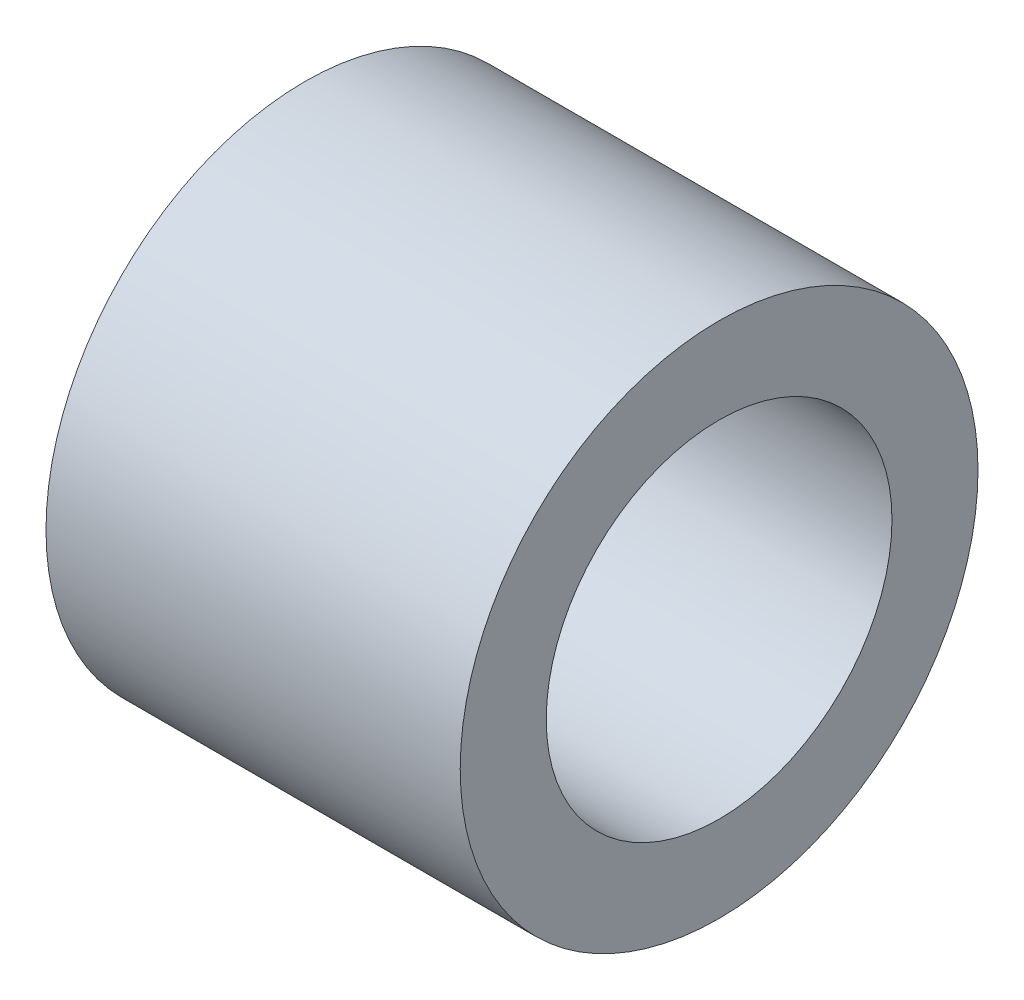
ISO-10303-21;
HEADER;
FILE_DESCRIPTION(('STEP AP214'),'2;1');
FILE_NAME('part.step','',(''),(''),'','','');
FILE_SCHEMA(('AUTOMOTIVE_DESIGN { 1 0 10303 214 1 1 1 1 }'));
ENDSEC;
DATA;
#1=APPLICATION_CONTEXT('core data for automotive mechanical design processes');
#2=APPLICATION_PROTOCOL_DEFINITION('international standard','automotive_design',2000,#1);
#3=PRODUCT_CONTEXT('',#1,'mechanical');
#4=PRODUCT('Part','Part','',(#3));
#5=PRODUCT_RELATED_PRODUCT_CATEGORY('part','',(#4));
#6=PRODUCT_DEFINITION_FORMATION('','',#4);
#7=PRODUCT_DEFINITION_CONTEXT('part definition',#1,'design');
#8=PRODUCT_DEFINITION('design','',#6,#7);
#9=PRODUCT_DEFINITION_SHAPE('','',#8);
#10=(LENGTH_UNIT() NAMED_UNIT(*) SI_UNIT(.MILLI.,.METRE.));
#11=(NAMED_UNIT(*) PLANE_ANGLE_UNIT() SI_UNIT($,.RADIAN.));
#12=(NAMED_UNIT(*) SI_UNIT($,.STERADIAN.) SOLID_ANGLE_UNIT());
#13=UNCERTAINTY_MEASURE_WITH_UNIT(LENGTH_MEASURE(1.E-05),#10,'distance_accuracy_value','');
#14=(GEOMETRIC_REPRESENTATION_CONTEXT(3) GLOBAL_UNCERTAINTY_ASSIGNED_CONTEXT((#13)) GLOBAL_UNIT_ASSIGNED_CONTEXT((#10,
#11,#12)) REPRESENTATION_CONTEXT('',''));
#15=CARTESIAN_POINT('',(0.,0.,0.));
#16=DIRECTION('',(0.,0.,1.));
#17=DIRECTION('',(1.,0.,0.));
#18=AXIS2_PLACEMENT_3D('',#15,#16,#17);
#19=CARTESIAN_POINT('',(6.35,0.,0.));
#20=DIRECTION('',(1.,0.,0.));
#21=DIRECTION('',(0.,0.,-1.));
#22=AXIS2_PLACEMENT_3D('',#19,#20,#21);
#23=PLANE('',#22);
#24=CARTESIAN_POINT('',(6.35,0.,0.));
#25=DIRECTION('',(1.,0.,0.));
#26=DIRECTION('',(0.,0.,-1.));
#27=AXIS2_PLACEMENT_3D('',#24,#25,#26);
#28=CIRCLE('',#27,3.96875);
#29=CARTESIAN_POINT('',(6.35,0.,-3.96875));
#30=VERTEX_POINT('',#29);
#31=EDGE_CURVE('E10',#30,#30,#28,.T.);
#32=ORIENTED_EDGE('',*,*,#31,.T.);
#33=EDGE_LOOP('',(#32));
#34=FACE_BOUND('',#33,.T.);
#35=CARTESIAN_POINT('',(6.35,0.,0.));
#36=DIRECTION('',(1.,0.,0.));
#37=DIRECTION('',(0.,0.,-1.));
#38=AXIS2_PLACEMENT_3D('',#35,#36,#37);
#39=CIRCLE('',#38,2.65);
#40=CARTESIAN_POINT('',(6.35,0.,-2.65));
#41=VERTEX_POINT('',#40);
#42=EDGE_CURVE('E41',#41,#41,#39,.T.);
#43=ORIENTED_EDGE('',*,*,#42,.F.);
#44=EDGE_LOOP('',(#43));
#45=FACE_BOUND('',#44,.T.);
#46=ADVANCED_FACE('F30',(#34,#45),#23,.T.);
#47=CARTESIAN_POINT('',(0.,0.,0.));
#48=DIRECTION('',(1.,0.,0.));
#49=DIRECTION('',(0.,0.,-1.));
#50=AXIS2_PLACEMENT_3D('',#47,#48,#49);
#51=PLANE('',#50);
#52=CARTESIAN_POINT('',(0.,0.,0.));
#53=DIRECTION('',(1.,0.,0.));
#54=DIRECTION('',(0.,0.,-1.));
#55=AXIS2_PLACEMENT_3D('',#52,#53,#54);
#56=CIRCLE('',#55,3.96875);
#57=CARTESIAN_POINT('',(0.,0.,-3.96875));
#58=VERTEX_POINT('',#57);
#59=EDGE_CURVE('E34',#58,#58,#56,.T.);
#60=ORIENTED_EDGE('',*,*,#59,.F.);
#61=EDGE_LOOP('',(#60));
#62=FACE_BOUND('',#61,.T.);
#63=CARTESIAN_POINT('',(0.,0.,0.));
#64=DIRECTION('',(1.,0.,0.));
#65=DIRECTION('',(0.,0.,-1.));
#66=AXIS2_PLACEMENT_3D('',#63,#64,#65);
#67=CIRCLE('',#66,2.65);
#68=CARTESIAN_POINT('',(0.,0.,-2.65));
#69=VERTEX_POINT('',#68);
#70=EDGE_CURVE('E43',#69,#69,#67,.T.);
#71=ORIENTED_EDGE('',*,*,#70,.T.);
#72=EDGE_LOOP('',(#71));
#73=FACE_BOUND('',#72,.T.);
#74=ADVANCED_FACE('F53',(#62,#73),#51,.F.);
#75=CARTESIAN_POINT('',(6.35,0.,0.));
#76=DIRECTION('',(-1.,0.,0.));
#77=DIRECTION('',(0.,0.,1.));
#78=AXIS2_PLACEMENT_3D('',#75,#76,#77);
#79=CYLINDRICAL_SURFACE('',#78,3.96875);
#80=ORIENTED_EDGE('',*,*,#31,.F.);
#81=EDGE_LOOP('',(#80));
#82=FACE_BOUND('',#81,.T.);
#83=ORIENTED_EDGE('',*,*,#59,.T.);
#84=EDGE_LOOP('',(#83));
#85=FACE_BOUND('',#84,.T.);
#86=ADVANCED_FACE('F32',(#82,#85),#79,.T.);
#87=CARTESIAN_POINT('',(6.35,0.,0.));
#88=DIRECTION('',(-1.,0.,0.));
#89=DIRECTION('',(0.,0.,1.));
#90=AXIS2_PLACEMENT_3D('',#87,#88,#89);
#91=CYLINDRICAL_SURFACE('',#90,2.65);
#92=ORIENTED_EDGE('',*,*,#42,.T.);
#93=EDGE_LOOP('',(#92));
#94=FACE_BOUND('',#93,.T.);
#95=ORIENTED_EDGE('',*,*,#70,.F.);
#96=EDGE_LOOP('',(#95));
#97=FACE_BOUND('',#96,.T.);
#98=ADVANCED_FACE('F49',(#94,#97),#91,.F.);
#99=CLOSED_SHELL('',(#46,#74,#86,#98));
#100=MANIFOLD_SOLID_BREP('B2',#99);
#101=ADVANCED_BREP_SHAPE_REPRESENTATION('',(#18,#100),#14);
#102=SHAPE_DEFINITION_REPRESENTATION(#9,#101);
ENDSEC;
END-ISO-10303-21;
